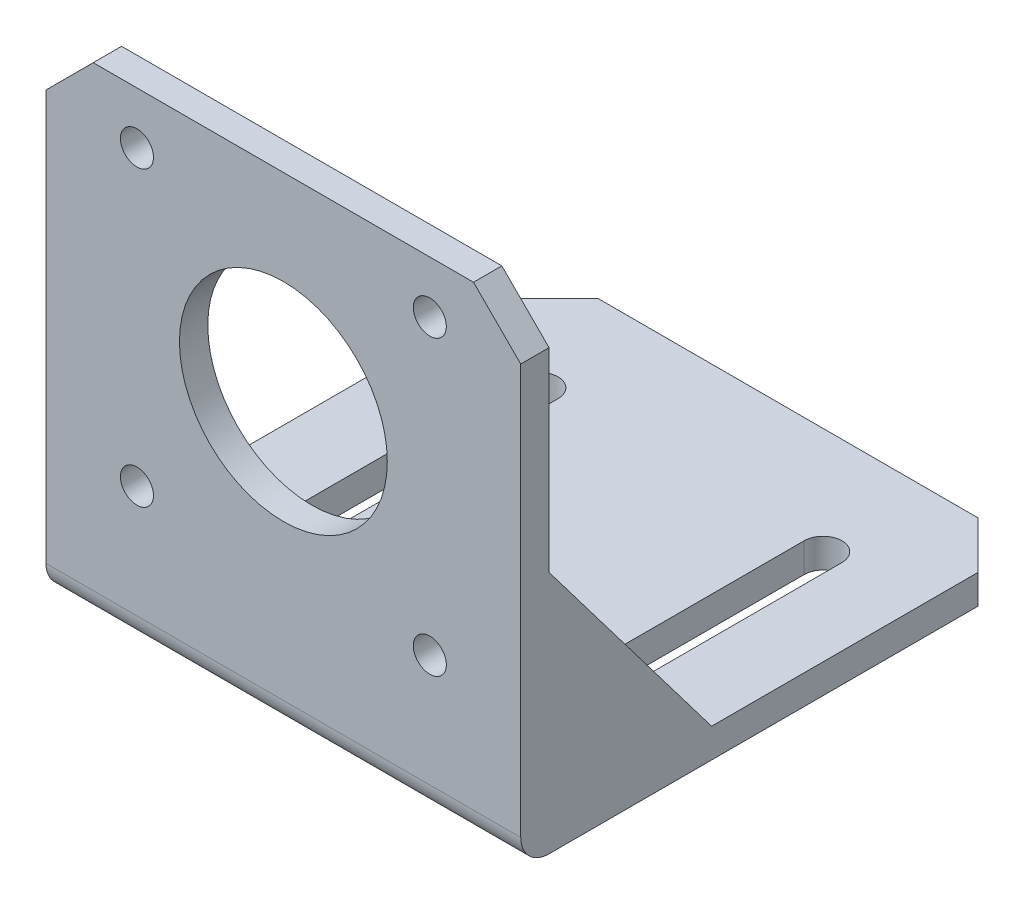
ISO-10303-21;
HEADER;
FILE_DESCRIPTION(('STEP AP214'),'2;1');
FILE_NAME('part.step','',(''),(''),'','','');
FILE_SCHEMA(('AUTOMOTIVE_DESIGN { 1 0 10303 214 1 1 1 1 }'));
ENDSEC;
DATA;
#1=APPLICATION_CONTEXT('core data for automotive mechanical design processes');
#2=APPLICATION_PROTOCOL_DEFINITION('international standard','automotive_design',2000,#1);
#3=PRODUCT_CONTEXT('',#1,'mechanical');
#4=PRODUCT('Part','Part','',(#3));
#5=PRODUCT_RELATED_PRODUCT_CATEGORY('part','',(#4));
#6=PRODUCT_DEFINITION_FORMATION('','',#4);
#7=PRODUCT_DEFINITION_CONTEXT('part definition',#1,'design');
#8=PRODUCT_DEFINITION('design','',#6,#7);
#9=PRODUCT_DEFINITION_SHAPE('','',#8);
#10=(LENGTH_UNIT() NAMED_UNIT(*) SI_UNIT(.MILLI.,.METRE.));
#11=(NAMED_UNIT(*) PLANE_ANGLE_UNIT() SI_UNIT($,.RADIAN.));
#12=(NAMED_UNIT(*) SI_UNIT($,.STERADIAN.) SOLID_ANGLE_UNIT());
#13=UNCERTAINTY_MEASURE_WITH_UNIT(LENGTH_MEASURE(1.E-05),#10,'distance_accuracy_value','');
#14=(GEOMETRIC_REPRESENTATION_CONTEXT(3) GLOBAL_UNCERTAINTY_ASSIGNED_CONTEXT((#13)) GLOBAL_UNIT_ASSIGNED_CONTEXT((#10,
#11,#12)) REPRESENTATION_CONTEXT('',''));
#15=CARTESIAN_POINT('',(0.,0.,0.));
#16=DIRECTION('',(0.,0.,1.));
#17=DIRECTION('',(1.,0.,0.));
#18=AXIS2_PLACEMENT_3D('',#15,#16,#17);
#19=CARTESIAN_POINT('',(0.,0.,0.));
#20=DIRECTION('',(0.,0.,-1.));
#21=DIRECTION('',(-1.,0.,0.));
#22=AXIS2_PLACEMENT_3D('',#19,#20,#21);
#23=PLANE('',#22);
#24=CARTESIAN_POINT('',(40.625,14.9,0.));
#25=DIRECTION('',(0.,0.,1.));
#26=DIRECTION('',(1.,0.,0.));
#27=AXIS2_PLACEMENT_3D('',#24,#25,#26);
#28=CIRCLE('',#27,1.75);
#29=CARTESIAN_POINT('',(42.375,14.9,0.));
#30=VERTEX_POINT('',#29);
#31=EDGE_CURVE('E346',#30,#30,#28,.T.);
#32=ORIENTED_EDGE('',*,*,#31,.T.);
#33=EDGE_LOOP('',(#32));
#34=FACE_BOUND('',#33,.T.);
#35=CARTESIAN_POINT('',(9.625,45.9,0.));
#36=DIRECTION('',(0.,0.,1.));
#37=DIRECTION('',(1.,0.,0.));
#38=AXIS2_PLACEMENT_3D('',#35,#36,#37);
#39=CIRCLE('',#38,1.75);
#40=CARTESIAN_POINT('',(11.375,45.9,0.));
#41=VERTEX_POINT('',#40);
#42=EDGE_CURVE('E358',#41,#41,#39,.T.);
#43=ORIENTED_EDGE('',*,*,#42,.T.);
#44=EDGE_LOOP('',(#43));
#45=FACE_BOUND('',#44,.T.);
#46=CARTESIAN_POINT('',(25.125,30.4,0.));
#47=DIRECTION('',(0.,0.,1.));
#48=DIRECTION('',(1.,0.,0.));
#49=AXIS2_PLACEMENT_3D('',#46,#47,#48);
#50=CIRCLE('',#49,11.);
#51=CARTESIAN_POINT('',(36.125,30.4,0.));
#52=VERTEX_POINT('',#51);
#53=EDGE_CURVE('E364',#52,#52,#50,.T.);
#54=ORIENTED_EDGE('',*,*,#53,.T.);
#55=EDGE_LOOP('',(#54));
#56=FACE_BOUND('',#55,.T.);
#57=CARTESIAN_POINT('',(40.625,45.9,0.));
#58=DIRECTION('',(0.,0.,1.));
#59=DIRECTION('',(-1.,0.,0.));
#60=AXIS2_PLACEMENT_3D('',#57,#58,#59);
#61=CIRCLE('',#60,1.75);
#62=CARTESIAN_POINT('',(38.875,45.9,0.));
#63=VERTEX_POINT('',#62);
#64=EDGE_CURVE('E352',#63,#63,#61,.T.);
#65=ORIENTED_EDGE('',*,*,#64,.T.);
#66=EDGE_LOOP('',(#65));
#67=FACE_BOUND('',#66,.T.);
#68=CARTESIAN_POINT('',(9.625,14.9,0.));
#69=DIRECTION('',(0.,0.,1.));
#70=DIRECTION('',(-1.,0.,0.));
#71=AXIS2_PLACEMENT_3D('',#68,#69,#70);
#72=CIRCLE('',#71,1.75);
#73=CARTESIAN_POINT('',(7.875,14.9,0.));
#74=VERTEX_POINT('',#73);
#75=EDGE_CURVE('E336',#74,#74,#72,.T.);
#76=ORIENTED_EDGE('',*,*,#75,.T.);
#77=EDGE_LOOP('',(#76));
#78=FACE_BOUND('',#77,.T.);
#79=DIRECTION('',(0.,-1.,0.));
#80=VECTOR('',#79,1.);
#81=CARTESIAN_POINT('',(47.65,0.,0.));
#82=LINE('',#81,#80);
#83=CARTESIAN_POINT('',(47.65,25.8,0.));
#84=VERTEX_POINT('',#83);
#85=CARTESIAN_POINT('',(47.65,6.1,0.));
#86=VERTEX_POINT('',#85);
#87=EDGE_CURVE('E197',#84,#86,#82,.T.);
#88=ORIENTED_EDGE('',*,*,#87,.T.);
#89=DIRECTION('',(-1.,0.,0.));
#90=VECTOR('',#89,1.);
#91=CARTESIAN_POINT('',(0.,6.1,0.));
#92=LINE('',#91,#90);
#93=CARTESIAN_POINT('',(2.6,6.1,0.));
#94=VERTEX_POINT('',#93);
#95=EDGE_CURVE('E226',#86,#94,#92,.T.);
#96=ORIENTED_EDGE('',*,*,#95,.T.);
#97=DIRECTION('',(0.,1.,0.));
#98=VECTOR('',#97,1.);
#99=CARTESIAN_POINT('',(2.6,0.,0.));
#100=LINE('',#99,#98);
#101=CARTESIAN_POINT('',(2.6,25.8,0.));
#102=VERTEX_POINT('',#101);
#103=EDGE_CURVE('E232',#94,#102,#100,.T.);
#104=ORIENTED_EDGE('',*,*,#103,.T.);
#105=DIRECTION('',(-1.,0.,0.));
#106=VECTOR('',#105,1.);
#107=CARTESIAN_POINT('',(2.6,25.8,0.));
#108=LINE('',#107,#106);
#109=CARTESIAN_POINT('',(0.,25.8,0.));
#110=VERTEX_POINT('',#109);
#111=EDGE_CURVE('E245',#102,#110,#108,.T.);
#112=ORIENTED_EDGE('',*,*,#111,.T.);
#113=DIRECTION('',(0.,-1.,0.));
#114=VECTOR('',#113,1.);
#115=CARTESIAN_POINT('',(0.,0.,0.));
#116=LINE('',#115,#114);
#117=CARTESIAN_POINT('',(0.,46.4,0.));
#118=VERTEX_POINT('',#117);
#119=EDGE_CURVE('E370',#118,#110,#116,.T.);
#120=ORIENTED_EDGE('',*,*,#119,.F.);
#121=DIRECTION('',(-0.707106781186547,-0.707106781186547,0.));
#122=VECTOR('',#121,1.);
#123=CARTESIAN_POINT('',(0.,46.4,0.));
#124=LINE('',#123,#122);
#125=CARTESIAN_POINT('',(5.,51.4,0.));
#126=VERTEX_POINT('',#125);
#127=EDGE_CURVE('E377',#126,#118,#124,.T.);
#128=ORIENTED_EDGE('',*,*,#127,.F.);
#129=DIRECTION('',(-1.,0.,0.));
#130=VECTOR('',#129,1.);
#131=CARTESIAN_POINT('',(5.,51.4,0.));
#132=LINE('',#131,#130);
#133=CARTESIAN_POINT('',(45.25,51.4,0.));
#134=VERTEX_POINT('',#133);
#135=EDGE_CURVE('E392',#134,#126,#132,.T.);
#136=ORIENTED_EDGE('',*,*,#135,.F.);
#137=DIRECTION('',(-0.707106781186547,0.707106781186547,0.));
#138=VECTOR('',#137,1.);
#139=CARTESIAN_POINT('',(50.25,46.4,0.));
#140=LINE('',#139,#138);
#141=CARTESIAN_POINT('',(50.25,46.4,0.));
#142=VERTEX_POINT('',#141);
#143=EDGE_CURVE('E390',#142,#134,#140,.T.);
#144=ORIENTED_EDGE('',*,*,#143,.F.);
#145=DIRECTION('',(0.,1.,0.));
#146=VECTOR('',#145,1.);
#147=CARTESIAN_POINT('',(50.25,0.,0.));
#148=LINE('',#147,#146);
#149=CARTESIAN_POINT('',(50.25,25.8,0.));
#150=VERTEX_POINT('',#149);
#151=EDGE_CURVE('E388',#150,#142,#148,.T.);
#152=ORIENTED_EDGE('',*,*,#151,.F.);
#153=DIRECTION('',(1.,0.,0.));
#154=VECTOR('',#153,1.);
#155=CARTESIAN_POINT('',(47.65,25.8,0.));
#156=LINE('',#155,#154);
#157=EDGE_CURVE('E208',#84,#150,#156,.T.);
#158=ORIENTED_EDGE('',*,*,#157,.F.);
#159=EDGE_LOOP('',(#88,#96,#104,#112,#120,#128,#136,#144,#152,#158));
#160=FACE_BOUND('',#159,.T.);
#161=ADVANCED_FACE('F32',(#34,#45,#56,#67,#78,#160),#23,.T.);
#162=CARTESIAN_POINT('',(0.,3.1,0.));
#163=DIRECTION('',(0.,-1.,0.));
#164=DIRECTION('',(0.,0.,-1.));
#165=AXIS2_PLACEMENT_3D('',#162,#163,#164);
#166=PLANE('',#165);
#167=DIRECTION('',(0.,0.,1.));
#168=VECTOR('',#167,1.);
#169=CARTESIAN_POINT('',(42.15,3.1,-9.09999999999999));
#170=LINE('',#169,#168);
#171=CARTESIAN_POINT('',(42.15,3.1,-39.1));
#172=VERTEX_POINT('',#171);
#173=CARTESIAN_POINT('',(42.15,3.1,-9.09999999999999));
#174=VERTEX_POINT('',#173);
#175=EDGE_CURVE('E289',#172,#174,#170,.T.);
#176=ORIENTED_EDGE('',*,*,#175,.T.);
#177=CARTESIAN_POINT('',(40.15,3.1,-9.09999999999999));
#178=DIRECTION('',(0.,-1.,0.));
#179=DIRECTION('',(0.,0.,-1.));
#180=AXIS2_PLACEMENT_3D('',#177,#178,#179);
#181=CIRCLE('',#180,2.00000000000002);
#182=CARTESIAN_POINT('',(38.15,3.1,-9.09999999999999));
#183=VERTEX_POINT('',#182);
#184=EDGE_CURVE('E279',#174,#183,#181,.T.);
#185=ORIENTED_EDGE('',*,*,#184,.T.);
#186=DIRECTION('',(0.,0.,-1.));
#187=VECTOR('',#186,1.);
#188=CARTESIAN_POINT('',(38.15,3.1,-9.09999999999999));
#189=LINE('',#188,#187);
#190=CARTESIAN_POINT('',(38.15,3.1,-39.1));
#191=VERTEX_POINT('',#190);
#192=EDGE_CURVE('E282',#183,#191,#189,.T.);
#193=ORIENTED_EDGE('',*,*,#192,.T.);
#194=CARTESIAN_POINT('',(40.15,3.1,-39.1));
#195=DIRECTION('',(0.,-1.,0.));
#196=DIRECTION('',(0.,0.,-1.));
#197=AXIS2_PLACEMENT_3D('',#194,#195,#196);
#198=CIRCLE('',#197,2.);
#199=EDGE_CURVE('E286',#191,#172,#198,.T.);
#200=ORIENTED_EDGE('',*,*,#199,.T.);
#201=EDGE_LOOP('',(#176,#185,#193,#200));
#202=FACE_BOUND('',#201,.T.);
#203=DIRECTION('',(0.,0.,1.));
#204=VECTOR('',#203,1.);
#205=CARTESIAN_POINT('',(12.1,3.1,-9.09999999999999));
#206=LINE('',#205,#204);
#207=CARTESIAN_POINT('',(12.1,3.1,-39.1));
#208=VERTEX_POINT('',#207);
#209=CARTESIAN_POINT('',(12.1,3.1,-9.09999999999999));
#210=VERTEX_POINT('',#209);
#211=EDGE_CURVE('E259',#208,#210,#206,.T.);
#212=ORIENTED_EDGE('',*,*,#211,.T.);
#213=CARTESIAN_POINT('',(10.1,3.1,-9.09999999999999));
#214=DIRECTION('',(0.,-1.,0.));
#215=DIRECTION('',(0.,0.,1.));
#216=AXIS2_PLACEMENT_3D('',#213,#214,#215);
#217=CIRCLE('',#216,2.00000000000002);
#218=CARTESIAN_POINT('',(8.09999999999998,3.1,-9.09999999999999));
#219=VERTEX_POINT('',#218);
#220=EDGE_CURVE('E249',#210,#219,#217,.T.);
#221=ORIENTED_EDGE('',*,*,#220,.T.);
#222=DIRECTION('',(0.,0.,-1.));
#223=VECTOR('',#222,1.);
#224=CARTESIAN_POINT('',(8.09999999999998,3.1,-9.09999999999999));
#225=LINE('',#224,#223);
#226=CARTESIAN_POINT('',(8.1,3.1,-39.1));
#227=VERTEX_POINT('',#226);
#228=EDGE_CURVE('E252',#219,#227,#225,.T.);
#229=ORIENTED_EDGE('',*,*,#228,.T.);
#230=CARTESIAN_POINT('',(10.1,3.1,-39.1));
#231=DIRECTION('',(0.,-1.,0.));
#232=DIRECTION('',(0.,0.,1.));
#233=AXIS2_PLACEMENT_3D('',#230,#231,#232);
#234=CIRCLE('',#233,2.);
#235=EDGE_CURVE('E256',#227,#208,#234,.T.);
#236=ORIENTED_EDGE('',*,*,#235,.T.);
#237=EDGE_LOOP('',(#212,#221,#229,#236));
#238=FACE_BOUND('',#237,.T.);
#239=DIRECTION('',(0.,0.,-1.));
#240=VECTOR('',#239,1.);
#241=CARTESIAN_POINT('',(2.6,3.1,0.));
#242=LINE('',#241,#240);
#243=CARTESIAN_POINT('',(2.6,3.1,-3.));
#244=VERTEX_POINT('',#243);
#245=CARTESIAN_POINT('',(2.6,3.1,-17.2));
#246=VERTEX_POINT('',#245);
#247=EDGE_CURVE('E212',#244,#246,#242,.T.);
#248=ORIENTED_EDGE('',*,*,#247,.F.);
#249=DIRECTION('',(-1.,0.,0.));
#250=VECTOR('',#249,1.);
#251=CARTESIAN_POINT('',(0.,3.1,-3.));
#252=LINE('',#251,#250);
#253=CARTESIAN_POINT('',(47.65,3.1,-3.));
#254=VERTEX_POINT('',#253);
#255=EDGE_CURVE('E40',#244,#254,#252,.F.);
#256=ORIENTED_EDGE('',*,*,#255,.T.);
#257=DIRECTION('',(0.,0.,1.));
#258=VECTOR('',#257,1.);
#259=CARTESIAN_POINT('',(47.65,3.1,0.));
#260=LINE('',#259,#258);
#261=CARTESIAN_POINT('',(47.65,3.1,-17.2));
#262=VERTEX_POINT('',#261);
#263=EDGE_CURVE('E194',#262,#254,#260,.T.);
#264=ORIENTED_EDGE('',*,*,#263,.F.);
#265=DIRECTION('',(1.,0.,0.));
#266=VECTOR('',#265,1.);
#267=CARTESIAN_POINT('',(47.65,3.1,-17.2));
#268=LINE('',#267,#266);
#269=CARTESIAN_POINT('',(50.25,3.1,-17.2));
#270=VERTEX_POINT('',#269);
#271=EDGE_CURVE('E200',#262,#270,#268,.T.);
#272=ORIENTED_EDGE('',*,*,#271,.T.);
#273=DIRECTION('',(0.,0.,1.));
#274=VECTOR('',#273,1.);
#275=CARTESIAN_POINT('',(50.25,3.1,3.));
#276=LINE('',#275,#274);
#277=CARTESIAN_POINT('',(50.25,3.1,-45.4));
#278=VERTEX_POINT('',#277);
#279=EDGE_CURVE('E323',#278,#270,#276,.T.);
#280=ORIENTED_EDGE('',*,*,#279,.F.);
#281=DIRECTION('',(0.707106781186547,0.,0.707106781186547));
#282=VECTOR('',#281,1.);
#283=CARTESIAN_POINT('',(50.25,3.1,-45.4));
#284=LINE('',#283,#282);
#285=CARTESIAN_POINT('',(45.25,3.1,-50.4));
#286=VERTEX_POINT('',#285);
#287=EDGE_CURVE('E320',#286,#278,#284,.T.);
#288=ORIENTED_EDGE('',*,*,#287,.F.);
#289=DIRECTION('',(1.,0.,0.));
#290=VECTOR('',#289,1.);
#291=CARTESIAN_POINT('',(5.00000000000001,3.1,-50.4));
#292=LINE('',#291,#290);
#293=CARTESIAN_POINT('',(5.00000000000001,3.1,-50.4));
#294=VERTEX_POINT('',#293);
#295=EDGE_CURVE('E317',#294,#286,#292,.T.);
#296=ORIENTED_EDGE('',*,*,#295,.F.);
#297=DIRECTION('',(0.707106781186547,0.,-0.707106781186547));
#298=VECTOR('',#297,1.);
#299=CARTESIAN_POINT('',(0.,3.1,-45.4));
#300=LINE('',#299,#298);
#301=CARTESIAN_POINT('',(0.,3.1,-45.4));
#302=VERTEX_POINT('',#301);
#303=EDGE_CURVE('E313',#302,#294,#300,.T.);
#304=ORIENTED_EDGE('',*,*,#303,.F.);
#305=DIRECTION('',(0.,0.,-1.));
#306=VECTOR('',#305,1.);
#307=CARTESIAN_POINT('',(0.,3.1,3.));
#308=LINE('',#307,#306);
#309=CARTESIAN_POINT('',(0.,3.1,-17.2));
#310=VERTEX_POINT('',#309);
#311=EDGE_CURVE('E311',#310,#302,#308,.T.);
#312=ORIENTED_EDGE('',*,*,#311,.F.);
#313=DIRECTION('',(-1.,0.,0.));
#314=VECTOR('',#313,1.);
#315=CARTESIAN_POINT('',(2.6,3.1,-17.2));
#316=LINE('',#315,#314);
#317=EDGE_CURVE('E240',#246,#310,#316,.T.);
#318=ORIENTED_EDGE('',*,*,#317,.F.);
#319=EDGE_LOOP('',(#248,#256,#264,#272,#280,#288,#296,#304,#312,#318));
#320=FACE_BOUND('',#319,.T.);
#321=ADVANCED_FACE('F210',(#202,#238,#320),#166,.F.);
#322=CARTESIAN_POINT('',(0.,0.,3.));
#323=DIRECTION('',(0.,0.,-1.));
#324=DIRECTION('',(-1.,0.,0.));
#325=AXIS2_PLACEMENT_3D('',#322,#323,#324);
#326=PLANE('',#325);
#327=DIRECTION('',(0.,-1.,0.));
#328=VECTOR('',#327,1.);
#329=CARTESIAN_POINT('',(0.,0.,3.));
#330=LINE('',#329,#328);
#331=CARTESIAN_POINT('',(0.,46.4,3.));
#332=VERTEX_POINT('',#331);
#333=CARTESIAN_POINT('',(0.,3.,3.));
#334=VERTEX_POINT('',#333);
#335=EDGE_CURVE('E373',#332,#334,#330,.T.);
#336=ORIENTED_EDGE('',*,*,#335,.T.);
#337=DIRECTION('',(1.,0.,0.));
#338=VECTOR('',#337,1.);
#339=CARTESIAN_POINT('',(0.,3.,3.));
#340=LINE('',#339,#338);
#341=CARTESIAN_POINT('',(50.25,3.,3.));
#342=VERTEX_POINT('',#341);
#343=EDGE_CURVE('E211',#334,#342,#340,.T.);
#344=ORIENTED_EDGE('',*,*,#343,.T.);
#345=DIRECTION('',(0.,1.,0.));
#346=VECTOR('',#345,1.);
#347=CARTESIAN_POINT('',(50.25,0.,3.));
#348=LINE('',#347,#346);
#349=CARTESIAN_POINT('',(50.25,46.4,3.));
#350=VERTEX_POINT('',#349);
#351=EDGE_CURVE('E376',#342,#350,#348,.T.);
#352=ORIENTED_EDGE('',*,*,#351,.T.);
#353=DIRECTION('',(-0.707106781186547,0.707106781186547,0.));
#354=VECTOR('',#353,1.);
#355=CARTESIAN_POINT('',(50.25,46.4,3.));
#356=LINE('',#355,#354);
#357=CARTESIAN_POINT('',(45.25,51.4,3.));
#358=VERTEX_POINT('',#357);
#359=EDGE_CURVE('E379',#350,#358,#356,.T.);
#360=ORIENTED_EDGE('',*,*,#359,.T.);
#361=DIRECTION('',(-1.,0.,0.));
#362=VECTOR('',#361,1.);
#363=CARTESIAN_POINT('',(5.,51.4,3.));
#364=LINE('',#363,#362);
#365=CARTESIAN_POINT('',(5.,51.4,3.));
#366=VERTEX_POINT('',#365);
#367=EDGE_CURVE('E381',#358,#366,#364,.T.);
#368=ORIENTED_EDGE('',*,*,#367,.T.);
#369=DIRECTION('',(-0.707106781186547,-0.707106781186547,0.));
#370=VECTOR('',#369,1.);
#371=CARTESIAN_POINT('',(0.,46.4,3.));
#372=LINE('',#371,#370);
#373=EDGE_CURVE('E383',#366,#332,#372,.T.);
#374=ORIENTED_EDGE('',*,*,#373,.T.);
#375=EDGE_LOOP('',(#336,#344,#352,#360,#368,#374));
#376=FACE_BOUND('',#375,.T.);
#377=CARTESIAN_POINT('',(25.125,30.4,3.));
#378=DIRECTION('',(0.,0.,1.));
#379=DIRECTION('',(1.,0.,0.));
#380=AXIS2_PLACEMENT_3D('',#377,#378,#379);
#381=CIRCLE('',#380,11.);
#382=CARTESIAN_POINT('',(36.125,30.4,3.));
#383=VERTEX_POINT('',#382);
#384=EDGE_CURVE('E367',#383,#383,#381,.T.);
#385=ORIENTED_EDGE('',*,*,#384,.F.);
#386=EDGE_LOOP('',(#385));
#387=FACE_BOUND('',#386,.T.);
#388=CARTESIAN_POINT('',(9.625,45.9,3.));
#389=DIRECTION('',(0.,0.,1.));
#390=DIRECTION('',(1.,0.,0.));
#391=AXIS2_PLACEMENT_3D('',#388,#389,#390);
#392=CIRCLE('',#391,1.75);
#393=CARTESIAN_POINT('',(11.375,45.9,3.));
#394=VERTEX_POINT('',#393);
#395=EDGE_CURVE('E361',#394,#394,#392,.T.);
#396=ORIENTED_EDGE('',*,*,#395,.F.);
#397=EDGE_LOOP('',(#396));
#398=FACE_BOUND('',#397,.T.);
#399=CARTESIAN_POINT('',(40.625,45.9,3.));
#400=DIRECTION('',(0.,0.,1.));
#401=DIRECTION('',(-1.,0.,0.));
#402=AXIS2_PLACEMENT_3D('',#399,#400,#401);
#403=CIRCLE('',#402,1.75);
#404=CARTESIAN_POINT('',(38.875,45.9,3.));
#405=VERTEX_POINT('',#404);
#406=EDGE_CURVE('E355',#405,#405,#403,.T.);
#407=ORIENTED_EDGE('',*,*,#406,.F.);
#408=EDGE_LOOP('',(#407));
#409=FACE_BOUND('',#408,.T.);
#410=CARTESIAN_POINT('',(40.625,14.9,3.));
#411=DIRECTION('',(0.,0.,1.));
#412=DIRECTION('',(1.,0.,0.));
#413=AXIS2_PLACEMENT_3D('',#410,#411,#412);
#414=CIRCLE('',#413,1.75);
#415=CARTESIAN_POINT('',(42.375,14.9,3.));
#416=VERTEX_POINT('',#415);
#417=EDGE_CURVE('E349',#416,#416,#414,.T.);
#418=ORIENTED_EDGE('',*,*,#417,.F.);
#419=EDGE_LOOP('',(#418));
#420=FACE_BOUND('',#419,.T.);
#421=CARTESIAN_POINT('',(9.625,14.9,3.));
#422=DIRECTION('',(0.,0.,1.));
#423=DIRECTION('',(-1.,0.,0.));
#424=AXIS2_PLACEMENT_3D('',#421,#422,#423);
#425=CIRCLE('',#424,1.75);
#426=CARTESIAN_POINT('',(7.875,14.9,3.));
#427=VERTEX_POINT('',#426);
#428=EDGE_CURVE('E343',#427,#427,#425,.T.);
#429=ORIENTED_EDGE('',*,*,#428,.F.);
#430=EDGE_LOOP('',(#429));
#431=FACE_BOUND('',#430,.T.);
#432=ADVANCED_FACE('F457',(#376,#387,#398,#409,#420,#431),#326,.F.);
#433=CARTESIAN_POINT('',(0.,0.,3.));
#434=DIRECTION('',(1.,0.,0.));
#435=DIRECTION('',(0.,0.,-1.));
#436=AXIS2_PLACEMENT_3D('',#433,#434,#435);
#437=PLANE('',#436);
#438=DIRECTION('',(0.,0.,-1.));
#439=VECTOR('',#438,1.);
#440=CARTESIAN_POINT('',(0.,0.,3.));
#441=LINE('',#440,#439);
#442=CARTESIAN_POINT('',(0.,0.,0.));
#443=VERTEX_POINT('',#442);
#444=CARTESIAN_POINT('',(0.,0.,-45.4));
#445=VERTEX_POINT('',#444);
#446=EDGE_CURVE('E217',#443,#445,#441,.T.);
#447=ORIENTED_EDGE('',*,*,#446,.F.);
#448=CARTESIAN_POINT('',(0.,3.,0.));
#449=DIRECTION('',(1.,0.,0.));
#450=DIRECTION('',(0.,0.,-1.));
#451=AXIS2_PLACEMENT_3D('',#448,#449,#450);
#452=CIRCLE('',#451,3.);
#453=EDGE_CURVE('E224',#443,#334,#452,.F.);
#454=ORIENTED_EDGE('',*,*,#453,.T.);
#455=ORIENTED_EDGE('',*,*,#335,.F.);
#456=DIRECTION('',(0.,0.,-1.));
#457=VECTOR('',#456,1.);
#458=CARTESIAN_POINT('',(0.,46.4,3.));
#459=LINE('',#458,#457);
#460=EDGE_CURVE('E385',#332,#118,#459,.T.);
#461=ORIENTED_EDGE('',*,*,#460,.T.);
#462=ORIENTED_EDGE('',*,*,#119,.T.);
#463=DIRECTION('',(0.,-0.79704093184609,-0.6039252875662));
#464=VECTOR('',#463,1.);
#465=CARTESIAN_POINT('',(0.,25.8,0.));
#466=LINE('',#465,#464);
#467=EDGE_CURVE('E436',#110,#310,#466,.T.);
#468=ORIENTED_EDGE('',*,*,#467,.T.);
#469=ORIENTED_EDGE('',*,*,#311,.T.);
#470=DIRECTION('',(0.,-1.,0.));
#471=VECTOR('',#470,1.);
#472=CARTESIAN_POINT('',(0.,3.1,-45.4));
#473=LINE('',#472,#471);
#474=EDGE_CURVE('E325',#302,#445,#473,.T.);
#475=ORIENTED_EDGE('',*,*,#474,.T.);
#476=EDGE_LOOP('',(#447,#454,#455,#461,#462,#468,#469,#475));
#477=FACE_BOUND('',#476,.T.);
#478=ADVANCED_FACE('F417',(#477),#437,.F.);
#479=CARTESIAN_POINT('',(0.,0.,3.));
#480=DIRECTION('',(0.,1.,0.));
#481=DIRECTION('',(0.,0.,1.));
#482=AXIS2_PLACEMENT_3D('',#479,#480,#481);
#483=PLANE('',#482);
#484=DIRECTION('',(0.,0.,-1.));
#485=VECTOR('',#484,1.);
#486=CARTESIAN_POINT('',(50.25,0.,3.));
#487=LINE('',#486,#485);
#488=CARTESIAN_POINT('',(50.25,0.,0.));
#489=VERTEX_POINT('',#488);
#490=CARTESIAN_POINT('',(50.25,0.,-45.4));
#491=VERTEX_POINT('',#490);
#492=EDGE_CURVE('E406',#489,#491,#487,.T.);
#493=ORIENTED_EDGE('',*,*,#492,.F.);
#494=DIRECTION('',(1.,0.,0.));
#495=VECTOR('',#494,1.);
#496=CARTESIAN_POINT('',(0.,0.,0.));
#497=LINE('',#496,#495);
#498=EDGE_CURVE('E222',#489,#443,#497,.F.);
#499=ORIENTED_EDGE('',*,*,#498,.T.);
#500=ORIENTED_EDGE('',*,*,#446,.T.);
#501=DIRECTION('',(0.707106781186547,0.,-0.707106781186547));
#502=VECTOR('',#501,1.);
#503=CARTESIAN_POINT('',(0.,0.,-45.4));
#504=LINE('',#503,#502);
#505=CARTESIAN_POINT('',(5.00000000000001,0.,-50.4));
#506=VERTEX_POINT('',#505);
#507=EDGE_CURVE('E304',#445,#506,#504,.T.);
#508=ORIENTED_EDGE('',*,*,#507,.T.);
#509=DIRECTION('',(1.,0.,0.));
#510=VECTOR('',#509,1.);
#511=CARTESIAN_POINT('',(5.00000000000001,0.,-50.4));
#512=LINE('',#511,#510);
#513=CARTESIAN_POINT('',(45.25,0.,-50.4));
#514=VERTEX_POINT('',#513);
#515=EDGE_CURVE('E328',#506,#514,#512,.T.);
#516=ORIENTED_EDGE('',*,*,#515,.T.);
#517=DIRECTION('',(0.707106781186547,0.,0.707106781186547));
#518=VECTOR('',#517,1.);
#519=CARTESIAN_POINT('',(50.25,0.,-45.4));
#520=LINE('',#519,#518);
#521=EDGE_CURVE('E314',#514,#491,#520,.T.);
#522=ORIENTED_EDGE('',*,*,#521,.T.);
#523=EDGE_LOOP('',(#493,#499,#500,#508,#516,#522));
#524=FACE_BOUND('',#523,.T.);
#525=CARTESIAN_POINT('',(40.15,0.,-9.09999999999999));
#526=DIRECTION('',(0.,-1.,0.));
#527=DIRECTION('',(0.,0.,-1.));
#528=AXIS2_PLACEMENT_3D('',#525,#526,#527);
#529=CIRCLE('',#528,2.00000000000002);
#530=CARTESIAN_POINT('',(42.15,0.,-9.09999999999999));
#531=VERTEX_POINT('',#530);
#532=CARTESIAN_POINT('',(38.15,0.,-9.09999999999999));
#533=VERTEX_POINT('',#532);
#534=EDGE_CURVE('E272',#531,#533,#529,.T.);
#535=ORIENTED_EDGE('',*,*,#534,.F.);
#536=DIRECTION('',(0.,0.,1.));
#537=VECTOR('',#536,1.);
#538=CARTESIAN_POINT('',(42.15,0.,-9.09999999999999));
#539=LINE('',#538,#537);
#540=CARTESIAN_POINT('',(42.15,0.,-39.1));
#541=VERTEX_POINT('',#540);
#542=EDGE_CURVE('E283',#541,#531,#539,.T.);
#543=ORIENTED_EDGE('',*,*,#542,.F.);
#544=CARTESIAN_POINT('',(40.15,0.,-39.1));
#545=DIRECTION('',(0.,-1.,0.));
#546=DIRECTION('',(0.,0.,-1.));
#547=AXIS2_PLACEMENT_3D('',#544,#545,#546);
#548=CIRCLE('',#547,2.);
#549=CARTESIAN_POINT('',(38.15,0.,-39.1));
#550=VERTEX_POINT('',#549);
#551=EDGE_CURVE('E297',#550,#541,#548,.T.);
#552=ORIENTED_EDGE('',*,*,#551,.F.);
#553=DIRECTION('',(0.,0.,-1.));
#554=VECTOR('',#553,1.);
#555=CARTESIAN_POINT('',(38.15,0.,-9.09999999999999));
#556=LINE('',#555,#554);
#557=EDGE_CURVE('E294',#533,#550,#556,.T.);
#558=ORIENTED_EDGE('',*,*,#557,.F.);
#559=EDGE_LOOP('',(#535,#543,#552,#558));
#560=FACE_BOUND('',#559,.T.);
#561=CARTESIAN_POINT('',(10.1,0.,-9.09999999999999));
#562=DIRECTION('',(0.,-1.,0.));
#563=DIRECTION('',(0.,0.,1.));
#564=AXIS2_PLACEMENT_3D('',#561,#562,#563);
#565=CIRCLE('',#564,2.00000000000002);
#566=CARTESIAN_POINT('',(12.1,0.,-9.09999999999999));
#567=VERTEX_POINT('',#566);
#568=CARTESIAN_POINT('',(8.09999999999998,0.,-9.09999999999999));
#569=VERTEX_POINT('',#568);
#570=EDGE_CURVE('E239',#567,#569,#565,.T.);
#571=ORIENTED_EDGE('',*,*,#570,.F.);
#572=DIRECTION('',(0.,0.,1.));
#573=VECTOR('',#572,1.);
#574=CARTESIAN_POINT('',(12.1,0.,-9.09999999999999));
#575=LINE('',#574,#573);
#576=CARTESIAN_POINT('',(12.1,0.,-39.1));
#577=VERTEX_POINT('',#576);
#578=EDGE_CURVE('E253',#577,#567,#575,.T.);
#579=ORIENTED_EDGE('',*,*,#578,.F.);
#580=CARTESIAN_POINT('',(10.1,0.,-39.1));
#581=DIRECTION('',(0.,-1.,0.));
#582=DIRECTION('',(0.,0.,1.));
#583=AXIS2_PLACEMENT_3D('',#580,#581,#582);
#584=CIRCLE('',#583,2.);
#585=CARTESIAN_POINT('',(8.1,0.,-39.1));
#586=VERTEX_POINT('',#585);
#587=EDGE_CURVE('E265',#586,#577,#584,.T.);
#588=ORIENTED_EDGE('',*,*,#587,.F.);
#589=DIRECTION('',(0.,0.,-1.));
#590=VECTOR('',#589,1.);
#591=CARTESIAN_POINT('',(8.09999999999998,0.,-9.09999999999999));
#592=LINE('',#591,#590);
#593=EDGE_CURVE('E242',#569,#586,#592,.T.);
#594=ORIENTED_EDGE('',*,*,#593,.F.);
#595=EDGE_LOOP('',(#571,#579,#588,#594));
#596=FACE_BOUND('',#595,.T.);
#597=ADVANCED_FACE('F410',(#524,#560,#596),#483,.F.);
#598=CARTESIAN_POINT('',(50.25,0.,3.));
#599=DIRECTION('',(-1.,0.,0.));
#600=DIRECTION('',(0.,0.,1.));
#601=AXIS2_PLACEMENT_3D('',#598,#599,#600);
#602=PLANE('',#601);
#603=ORIENTED_EDGE('',*,*,#351,.F.);
#604=CARTESIAN_POINT('',(50.25,3.,0.));
#605=DIRECTION('',(-1.,0.,0.));
#606=DIRECTION('',(0.,0.,1.));
#607=AXIS2_PLACEMENT_3D('',#604,#605,#606);
#608=CIRCLE('',#607,3.);
#609=EDGE_CURVE('E215',#342,#489,#608,.F.);
#610=ORIENTED_EDGE('',*,*,#609,.T.);
#611=ORIENTED_EDGE('',*,*,#492,.T.);
#612=DIRECTION('',(0.,-1.,0.));
#613=VECTOR('',#612,1.);
#614=CARTESIAN_POINT('',(50.25,3.1,-45.4));
#615=LINE('',#614,#613);
#616=EDGE_CURVE('E333',#278,#491,#615,.T.);
#617=ORIENTED_EDGE('',*,*,#616,.F.);
#618=ORIENTED_EDGE('',*,*,#279,.T.);
#619=DIRECTION('',(0.,-0.79704093184609,-0.6039252875662));
#620=VECTOR('',#619,1.);
#621=CARTESIAN_POINT('',(50.25,25.8,0.));
#622=LINE('',#621,#620);
#623=EDGE_CURVE('E201',#150,#270,#622,.T.);
#624=ORIENTED_EDGE('',*,*,#623,.F.);
#625=ORIENTED_EDGE('',*,*,#151,.T.);
#626=DIRECTION('',(0.,0.,-1.));
#627=VECTOR('',#626,1.);
#628=CARTESIAN_POINT('',(50.25,46.4,3.));
#629=LINE('',#628,#627);
#630=EDGE_CURVE('E403',#350,#142,#629,.T.);
#631=ORIENTED_EDGE('',*,*,#630,.F.);
#632=EDGE_LOOP('',(#603,#610,#611,#617,#618,#624,#625,#631));
#633=FACE_BOUND('',#632,.T.);
#634=ADVANCED_FACE('F432',(#633),#602,.F.);
#635=CARTESIAN_POINT('',(50.25,46.4,3.));
#636=DIRECTION('',(-0.707106781186548,-0.707106781186548,0.));
#637=DIRECTION('',(0.707106781186548,-0.707106781186548,0.));
#638=AXIS2_PLACEMENT_3D('',#635,#636,#637);
#639=PLANE('',#638);
#640=ORIENTED_EDGE('',*,*,#143,.T.);
#641=DIRECTION('',(0.,0.,-1.));
#642=VECTOR('',#641,1.);
#643=CARTESIAN_POINT('',(45.25,51.4,3.));
#644=LINE('',#643,#642);
#645=EDGE_CURVE('E400',#358,#134,#644,.T.);
#646=ORIENTED_EDGE('',*,*,#645,.F.);
#647=ORIENTED_EDGE('',*,*,#359,.F.);
#648=ORIENTED_EDGE('',*,*,#630,.T.);
#649=EDGE_LOOP('',(#640,#646,#647,#648));
#650=FACE_BOUND('',#649,.T.);
#651=ADVANCED_FACE('F449',(#650),#639,.F.);
#652=CARTESIAN_POINT('',(5.,51.4,3.));
#653=DIRECTION('',(0.,-1.,0.));
#654=DIRECTION('',(0.,0.,-1.));
#655=AXIS2_PLACEMENT_3D('',#652,#653,#654);
#656=PLANE('',#655);
#657=ORIENTED_EDGE('',*,*,#135,.T.);
#658=DIRECTION('',(0.,0.,-1.));
#659=VECTOR('',#658,1.);
#660=CARTESIAN_POINT('',(5.,51.4,3.));
#661=LINE('',#660,#659);
#662=EDGE_CURVE('E397',#366,#126,#661,.T.);
#663=ORIENTED_EDGE('',*,*,#662,.F.);
#664=ORIENTED_EDGE('',*,*,#367,.F.);
#665=ORIENTED_EDGE('',*,*,#645,.T.);
#666=EDGE_LOOP('',(#657,#663,#664,#665));
#667=FACE_BOUND('',#666,.T.);
#668=ADVANCED_FACE('F453',(#667),#656,.F.);
#669=CARTESIAN_POINT('',(0.,46.4,3.));
#670=DIRECTION('',(0.707106781186548,-0.707106781186548,0.));
#671=DIRECTION('',(0.707106781186548,0.707106781186548,0.));
#672=AXIS2_PLACEMENT_3D('',#669,#670,#671);
#673=PLANE('',#672);
#674=ORIENTED_EDGE('',*,*,#127,.T.);
#675=ORIENTED_EDGE('',*,*,#460,.F.);
#676=ORIENTED_EDGE('',*,*,#373,.F.);
#677=ORIENTED_EDGE('',*,*,#662,.T.);
#678=EDGE_LOOP('',(#674,#675,#676,#677));
#679=FACE_BOUND('',#678,.T.);
#680=ADVANCED_FACE('F466',(#679),#673,.F.);
#681=CARTESIAN_POINT('',(25.125,30.4,3.));
#682=DIRECTION('',(0.,0.,-1.));
#683=DIRECTION('',(-1.,0.,0.));
#684=AXIS2_PLACEMENT_3D('',#681,#682,#683);
#685=CYLINDRICAL_SURFACE('',#684,11.);
#686=ORIENTED_EDGE('',*,*,#384,.T.);
#687=EDGE_LOOP('',(#686));
#688=FACE_BOUND('',#687,.T.);
#689=ORIENTED_EDGE('',*,*,#53,.F.);
#690=EDGE_LOOP('',(#689));
#691=FACE_BOUND('',#690,.T.);
#692=ADVANCED_FACE('F468',(#688,#691),#685,.F.);
#693=CARTESIAN_POINT('',(9.625,45.9,3.));
#694=DIRECTION('',(0.,0.,-1.));
#695=DIRECTION('',(-1.,0.,0.));
#696=AXIS2_PLACEMENT_3D('',#693,#694,#695);
#697=CYLINDRICAL_SURFACE('',#696,1.75);
#698=ORIENTED_EDGE('',*,*,#395,.T.);
#699=EDGE_LOOP('',(#698));
#700=FACE_BOUND('',#699,.T.);
#701=ORIENTED_EDGE('',*,*,#42,.F.);
#702=EDGE_LOOP('',(#701));
#703=FACE_BOUND('',#702,.T.);
#704=ADVANCED_FACE('F474',(#700,#703),#697,.F.);
#705=CARTESIAN_POINT('',(40.625,45.9,3.));
#706=DIRECTION('',(0.,0.,-1.));
#707=DIRECTION('',(-1.,0.,0.));
#708=AXIS2_PLACEMENT_3D('',#705,#706,#707);
#709=CYLINDRICAL_SURFACE('',#708,1.75);
#710=ORIENTED_EDGE('',*,*,#406,.T.);
#711=EDGE_LOOP('',(#710));
#712=FACE_BOUND('',#711,.T.);
#713=ORIENTED_EDGE('',*,*,#64,.F.);
#714=EDGE_LOOP('',(#713));
#715=FACE_BOUND('',#714,.T.);
#716=ADVANCED_FACE('F492',(#712,#715),#709,.F.);
#717=CARTESIAN_POINT('',(40.625,14.9,3.));
#718=DIRECTION('',(0.,0.,-1.));
#719=DIRECTION('',(-1.,0.,0.));
#720=AXIS2_PLACEMENT_3D('',#717,#718,#719);
#721=CYLINDRICAL_SURFACE('',#720,1.75);
#722=ORIENTED_EDGE('',*,*,#417,.T.);
#723=EDGE_LOOP('',(#722));
#724=FACE_BOUND('',#723,.T.);
#725=ORIENTED_EDGE('',*,*,#31,.F.);
#726=EDGE_LOOP('',(#725));
#727=FACE_BOUND('',#726,.T.);
#728=ADVANCED_FACE('F496',(#724,#727),#721,.F.);
#729=CARTESIAN_POINT('',(9.625,14.9,3.));
#730=DIRECTION('',(0.,0.,-1.));
#731=DIRECTION('',(-1.,0.,0.));
#732=AXIS2_PLACEMENT_3D('',#729,#730,#731);
#733=CYLINDRICAL_SURFACE('',#732,1.75);
#734=ORIENTED_EDGE('',*,*,#428,.T.);
#735=EDGE_LOOP('',(#734));
#736=FACE_BOUND('',#735,.T.);
#737=ORIENTED_EDGE('',*,*,#75,.F.);
#738=EDGE_LOOP('',(#737));
#739=FACE_BOUND('',#738,.T.);
#740=ADVANCED_FACE('F500',(#736,#739),#733,.F.);
#741=CARTESIAN_POINT('',(50.25,3.1,-45.4));
#742=DIRECTION('',(0.707106781186547,0.,-0.707106781186547));
#743=DIRECTION('',(-0.707106781186548,0.,-0.707106781186548));
#744=AXIS2_PLACEMENT_3D('',#741,#742,#743);
#745=PLANE('',#744);
#746=ORIENTED_EDGE('',*,*,#521,.F.);
#747=DIRECTION('',(0.,-1.,0.));
#748=VECTOR('',#747,1.);
#749=CARTESIAN_POINT('',(45.25,3.1,-50.4));
#750=LINE('',#749,#748);
#751=EDGE_CURVE('E337',#286,#514,#750,.T.);
#752=ORIENTED_EDGE('',*,*,#751,.F.);
#753=ORIENTED_EDGE('',*,*,#287,.T.);
#754=ORIENTED_EDGE('',*,*,#616,.T.);
#755=EDGE_LOOP('',(#746,#752,#753,#754));
#756=FACE_BOUND('',#755,.T.);
#757=ADVANCED_FACE('F428',(#756),#745,.T.);
#758=CARTESIAN_POINT('',(5.00000000000001,3.1,-50.4));
#759=DIRECTION('',(0.,0.,-1.));
#760=DIRECTION('',(-1.,0.,0.));
#761=AXIS2_PLACEMENT_3D('',#758,#759,#760);
#762=PLANE('',#761);
#763=ORIENTED_EDGE('',*,*,#515,.F.);
#764=DIRECTION('',(0.,-1.,0.));
#765=VECTOR('',#764,1.);
#766=CARTESIAN_POINT('',(5.00000000000001,3.1,-50.4));
#767=LINE('',#766,#765);
#768=EDGE_CURVE('E339',#294,#506,#767,.T.);
#769=ORIENTED_EDGE('',*,*,#768,.F.);
#770=ORIENTED_EDGE('',*,*,#295,.T.);
#771=ORIENTED_EDGE('',*,*,#751,.T.);
#772=EDGE_LOOP('',(#763,#769,#770,#771));
#773=FACE_BOUND('',#772,.T.);
#774=ADVANCED_FACE('F425',(#773),#762,.T.);
#775=CARTESIAN_POINT('',(0.,3.1,-45.4));
#776=DIRECTION('',(-0.707106781186547,0.,-0.707106781186547));
#777=DIRECTION('',(-0.707106781186548,0.,0.707106781186548));
#778=AXIS2_PLACEMENT_3D('',#775,#776,#777);
#779=PLANE('',#778);
#780=ORIENTED_EDGE('',*,*,#507,.F.);
#781=ORIENTED_EDGE('',*,*,#474,.F.);
#782=ORIENTED_EDGE('',*,*,#303,.T.);
#783=ORIENTED_EDGE('',*,*,#768,.T.);
#784=EDGE_LOOP('',(#780,#781,#782,#783));
#785=FACE_BOUND('',#784,.T.);
#786=ADVANCED_FACE('F421',(#785),#779,.T.);
#787=CARTESIAN_POINT('',(40.15,3.1,-9.09999999999999));
#788=DIRECTION('',(0.,-1.,0.));
#789=DIRECTION('',(0.,0.,-1.));
#790=AXIS2_PLACEMENT_3D('',#787,#788,#789);
#791=CYLINDRICAL_SURFACE('',#790,2.00000000000002);
#792=ORIENTED_EDGE('',*,*,#534,.T.);
#793=DIRECTION('',(0.,-1.,0.));
#794=VECTOR('',#793,1.);
#795=CARTESIAN_POINT('',(38.15,3.1,-9.09999999999999));
#796=LINE('',#795,#794);
#797=EDGE_CURVE('E292',#183,#533,#796,.T.);
#798=ORIENTED_EDGE('',*,*,#797,.F.);
#799=ORIENTED_EDGE('',*,*,#184,.F.);
#800=DIRECTION('',(0.,-1.,0.));
#801=VECTOR('',#800,1.);
#802=CARTESIAN_POINT('',(42.15,3.1,-9.09999999999999));
#803=LINE('',#802,#801);
#804=EDGE_CURVE('E302',#174,#531,#803,.T.);
#805=ORIENTED_EDGE('',*,*,#804,.T.);
#806=EDGE_LOOP('',(#792,#798,#799,#805));
#807=FACE_BOUND('',#806,.T.);
#808=ADVANCED_FACE('F507',(#807),#791,.F.);
#809=CARTESIAN_POINT('',(42.15,3.1,-9.09999999999999));
#810=DIRECTION('',(1.,0.,0.));
#811=DIRECTION('',(0.,0.,-1.));
#812=AXIS2_PLACEMENT_3D('',#809,#810,#811);
#813=PLANE('',#812);
#814=ORIENTED_EDGE('',*,*,#542,.T.);
#815=ORIENTED_EDGE('',*,*,#804,.F.);
#816=ORIENTED_EDGE('',*,*,#175,.F.);
#817=DIRECTION('',(0.,-1.,0.));
#818=VECTOR('',#817,1.);
#819=CARTESIAN_POINT('',(42.15,3.1,-39.1));
#820=LINE('',#819,#818);
#821=EDGE_CURVE('E305',#172,#541,#820,.T.);
#822=ORIENTED_EDGE('',*,*,#821,.T.);
#823=EDGE_LOOP('',(#814,#815,#816,#822));
#824=FACE_BOUND('',#823,.T.);
#825=ADVANCED_FACE('F514',(#824),#813,.F.);
#826=CARTESIAN_POINT('',(40.15,3.1,-39.1));
#827=DIRECTION('',(0.,-1.,0.));
#828=DIRECTION('',(0.,0.,-1.));
#829=AXIS2_PLACEMENT_3D('',#826,#827,#828);
#830=CYLINDRICAL_SURFACE('',#829,2.);
#831=ORIENTED_EDGE('',*,*,#551,.T.);
#832=ORIENTED_EDGE('',*,*,#821,.F.);
#833=ORIENTED_EDGE('',*,*,#199,.F.);
#834=DIRECTION('',(0.,-1.,0.));
#835=VECTOR('',#834,1.);
#836=CARTESIAN_POINT('',(38.15,3.1,-39.1));
#837=LINE('',#836,#835);
#838=EDGE_CURVE('E307',#191,#550,#837,.T.);
#839=ORIENTED_EDGE('',*,*,#838,.T.);
#840=EDGE_LOOP('',(#831,#832,#833,#839));
#841=FACE_BOUND('',#840,.T.);
#842=ADVANCED_FACE('F520',(#841),#830,.F.);
#843=CARTESIAN_POINT('',(38.15,3.1,-9.09999999999999));
#844=DIRECTION('',(-1.,0.,0.));
#845=DIRECTION('',(0.,0.,1.));
#846=AXIS2_PLACEMENT_3D('',#843,#844,#845);
#847=PLANE('',#846);
#848=ORIENTED_EDGE('',*,*,#557,.T.);
#849=ORIENTED_EDGE('',*,*,#838,.F.);
#850=ORIENTED_EDGE('',*,*,#192,.F.);
#851=ORIENTED_EDGE('',*,*,#797,.T.);
#852=EDGE_LOOP('',(#848,#849,#850,#851));
#853=FACE_BOUND('',#852,.T.);
#854=ADVANCED_FACE('F516',(#853),#847,.F.);
#855=CARTESIAN_POINT('',(10.1,3.1,-9.09999999999999));
#856=DIRECTION('',(0.,-1.,0.));
#857=DIRECTION('',(0.,0.,-1.));
#858=AXIS2_PLACEMENT_3D('',#855,#856,#857);
#859=CYLINDRICAL_SURFACE('',#858,2.00000000000002);
#860=ORIENTED_EDGE('',*,*,#570,.T.);
#861=DIRECTION('',(0.,-1.,0.));
#862=VECTOR('',#861,1.);
#863=CARTESIAN_POINT('',(8.09999999999998,3.1,-9.09999999999999));
#864=LINE('',#863,#862);
#865=EDGE_CURVE('E261',#219,#569,#864,.T.);
#866=ORIENTED_EDGE('',*,*,#865,.F.);
#867=ORIENTED_EDGE('',*,*,#220,.F.);
#868=DIRECTION('',(0.,-1.,0.));
#869=VECTOR('',#868,1.);
#870=CARTESIAN_POINT('',(12.1,3.1,-9.09999999999999));
#871=LINE('',#870,#869);
#872=EDGE_CURVE('E270',#210,#567,#871,.T.);
#873=ORIENTED_EDGE('',*,*,#872,.T.);
#874=EDGE_LOOP('',(#860,#866,#867,#873));
#875=FACE_BOUND('',#874,.T.);
#876=ADVANCED_FACE('F519',(#875),#859,.F.);
#877=CARTESIAN_POINT('',(12.1,3.1,-9.09999999999999));
#878=DIRECTION('',(1.,0.,0.));
#879=DIRECTION('',(0.,0.,-1.));
#880=AXIS2_PLACEMENT_3D('',#877,#878,#879);
#881=PLANE('',#880);
#882=ORIENTED_EDGE('',*,*,#578,.T.);
#883=ORIENTED_EDGE('',*,*,#872,.F.);
#884=ORIENTED_EDGE('',*,*,#211,.F.);
#885=DIRECTION('',(0.,-1.,0.));
#886=VECTOR('',#885,1.);
#887=CARTESIAN_POINT('',(12.1,3.1,-39.1));
#888=LINE('',#887,#886);
#889=EDGE_CURVE('E273',#208,#577,#888,.T.);
#890=ORIENTED_EDGE('',*,*,#889,.T.);
#891=EDGE_LOOP('',(#882,#883,#884,#890));
#892=FACE_BOUND('',#891,.T.);
#893=ADVANCED_FACE('F530',(#892),#881,.F.);
#894=CARTESIAN_POINT('',(10.1,3.1,-39.1));
#895=DIRECTION('',(0.,-1.,0.));
#896=DIRECTION('',(0.,0.,-1.));
#897=AXIS2_PLACEMENT_3D('',#894,#895,#896);
#898=CYLINDRICAL_SURFACE('',#897,2.);
#899=ORIENTED_EDGE('',*,*,#587,.T.);
#900=ORIENTED_EDGE('',*,*,#889,.F.);
#901=ORIENTED_EDGE('',*,*,#235,.F.);
#902=DIRECTION('',(0.,-1.,0.));
#903=VECTOR('',#902,1.);
#904=CARTESIAN_POINT('',(8.1,3.1,-39.1));
#905=LINE('',#904,#903);
#906=EDGE_CURVE('E275',#227,#586,#905,.T.);
#907=ORIENTED_EDGE('',*,*,#906,.T.);
#908=EDGE_LOOP('',(#899,#900,#901,#907));
#909=FACE_BOUND('',#908,.T.);
#910=ADVANCED_FACE('F535',(#909),#898,.F.);
#911=CARTESIAN_POINT('',(8.09999999999998,3.1,-9.09999999999999));
#912=DIRECTION('',(-1.,0.,0.));
#913=DIRECTION('',(0.,0.,1.));
#914=AXIS2_PLACEMENT_3D('',#911,#912,#913);
#915=PLANE('',#914);
#916=ORIENTED_EDGE('',*,*,#593,.T.);
#917=ORIENTED_EDGE('',*,*,#906,.F.);
#918=ORIENTED_EDGE('',*,*,#228,.F.);
#919=ORIENTED_EDGE('',*,*,#865,.T.);
#920=EDGE_LOOP('',(#916,#917,#918,#919));
#921=FACE_BOUND('',#920,.T.);
#922=ADVANCED_FACE('F532',(#921),#915,.F.);
#923=CARTESIAN_POINT('',(2.6,25.8,0.));
#924=DIRECTION('',(0.,0.6039252875662,-0.79704093184609));
#925=DIRECTION('',(0.,0.79704093184609,0.6039252875662));
#926=AXIS2_PLACEMENT_3D('',#923,#924,#925);
#927=PLANE('',#926);
#928=ORIENTED_EDGE('',*,*,#467,.F.);
#929=ORIENTED_EDGE('',*,*,#111,.F.);
#930=DIRECTION('',(0.,-0.79704093184609,-0.6039252875662));
#931=VECTOR('',#930,1.);
#932=CARTESIAN_POINT('',(2.6,25.8,0.));
#933=LINE('',#932,#931);
#934=EDGE_CURVE('E238',#102,#246,#933,.T.);
#935=ORIENTED_EDGE('',*,*,#934,.T.);
#936=ORIENTED_EDGE('',*,*,#317,.T.);
#937=EDGE_LOOP('',(#928,#929,#935,#936));
#938=FACE_BOUND('',#937,.T.);
#939=ADVANCED_FACE('F435',(#938),#927,.T.);
#940=CARTESIAN_POINT('',(2.6,0.,0.));
#941=DIRECTION('',(-1.,0.,0.));
#942=DIRECTION('',(0.,0.,1.));
#943=AXIS2_PLACEMENT_3D('',#940,#941,#942);
#944=PLANE('',#943);
#945=ORIENTED_EDGE('',*,*,#103,.F.);
#946=CARTESIAN_POINT('',(2.6,6.1,-3.));
#947=DIRECTION('',(-1.,0.,0.));
#948=DIRECTION('',(0.,0.,1.));
#949=AXIS2_PLACEMENT_3D('',#946,#947,#948);
#950=CIRCLE('',#949,3.);
#951=EDGE_CURVE('E54',#94,#244,#950,.F.);
#952=ORIENTED_EDGE('',*,*,#951,.T.);
#953=ORIENTED_EDGE('',*,*,#247,.T.);
#954=ORIENTED_EDGE('',*,*,#934,.F.);
#955=EDGE_LOOP('',(#945,#952,#953,#954));
#956=FACE_BOUND('',#955,.T.);
#957=ADVANCED_FACE('F236',(#956),#944,.F.);
#958=CARTESIAN_POINT('',(47.65,25.8,0.));
#959=DIRECTION('',(0.,-0.6039252875662,0.79704093184609));
#960=DIRECTION('',(0.,-0.79704093184609,-0.6039252875662));
#961=AXIS2_PLACEMENT_3D('',#958,#959,#960);
#962=PLANE('',#961);
#963=ORIENTED_EDGE('',*,*,#623,.T.);
#964=ORIENTED_EDGE('',*,*,#271,.F.);
#965=DIRECTION('',(0.,-0.79704093184609,-0.6039252875662));
#966=VECTOR('',#965,1.);
#967=CARTESIAN_POINT('',(47.65,25.8,0.));
#968=LINE('',#967,#966);
#969=EDGE_CURVE('E191',#84,#262,#968,.T.);
#970=ORIENTED_EDGE('',*,*,#969,.F.);
#971=ORIENTED_EDGE('',*,*,#157,.T.);
#972=EDGE_LOOP('',(#963,#964,#970,#971));
#973=FACE_BOUND('',#972,.T.);
#974=ADVANCED_FACE('F204',(#973),#962,.F.);
#975=CARTESIAN_POINT('',(47.65,0.,0.));
#976=DIRECTION('',(1.,0.,0.));
#977=DIRECTION('',(0.,0.,1.));
#978=AXIS2_PLACEMENT_3D('',#975,#976,#977);
#979=PLANE('',#978);
#980=ORIENTED_EDGE('',*,*,#263,.T.);
#981=CARTESIAN_POINT('',(47.65,6.1,-3.));
#982=DIRECTION('',(1.,0.,0.));
#983=DIRECTION('',(0.,0.,-1.));
#984=AXIS2_PLACEMENT_3D('',#981,#982,#983);
#985=CIRCLE('',#984,3.);
#986=EDGE_CURVE('E11',#254,#86,#985,.F.);
#987=ORIENTED_EDGE('',*,*,#986,.T.);
#988=ORIENTED_EDGE('',*,*,#87,.F.);
#989=ORIENTED_EDGE('',*,*,#969,.T.);
#990=EDGE_LOOP('',(#980,#987,#988,#989));
#991=FACE_BOUND('',#990,.T.);
#992=ADVANCED_FACE('F193',(#991),#979,.F.);
#993=CARTESIAN_POINT('',(0.,3.,0.));
#994=DIRECTION('',(1.,0.,0.));
#995=DIRECTION('',(0.,0.,-1.));
#996=AXIS2_PLACEMENT_3D('',#993,#994,#995);
#997=CYLINDRICAL_SURFACE('',#996,3.);
#998=ORIENTED_EDGE('',*,*,#453,.F.);
#999=ORIENTED_EDGE('',*,*,#498,.F.);
#1000=ORIENTED_EDGE('',*,*,#609,.F.);
#1001=ORIENTED_EDGE('',*,*,#343,.F.);
#1002=EDGE_LOOP('',(#998,#999,#1000,#1001));
#1003=FACE_BOUND('',#1002,.T.);
#1004=ADVANCED_FACE('F462',(#1003),#997,.T.);
#1005=CARTESIAN_POINT('',(0.,6.1,-3.));
#1006=DIRECTION('',(-1.,0.,0.));
#1007=DIRECTION('',(0.,0.,1.));
#1008=AXIS2_PLACEMENT_3D('',#1005,#1006,#1007);
#1009=CYLINDRICAL_SURFACE('',#1008,3.);
#1010=ORIENTED_EDGE('',*,*,#986,.F.);
#1011=ORIENTED_EDGE('',*,*,#255,.F.);
#1012=ORIENTED_EDGE('',*,*,#951,.F.);
#1013=ORIENTED_EDGE('',*,*,#95,.F.);
#1014=EDGE_LOOP('',(#1010,#1011,#1012,#1013));
#1015=FACE_BOUND('',#1014,.T.);
#1016=ADVANCED_FACE('F34',(#1015),#1009,.F.);
#1017=CLOSED_SHELL('',(#161,#321,#432,#478,#597,#634,#651,#668,#680,#692,#704,#716,#728,#740,
#757,#774,#786,#808,#825,#842,#854,#876,#893,#910,#922,#939,#957,#974,#992,#1004,#1016));
#1018=MANIFOLD_SOLID_BREP('B2',#1017);
#1019=ADVANCED_BREP_SHAPE_REPRESENTATION('',(#18,#1018),#14);
#1020=SHAPE_DEFINITION_REPRESENTATION(#9,#1019);
ENDSEC;
END-ISO-10303-21;
